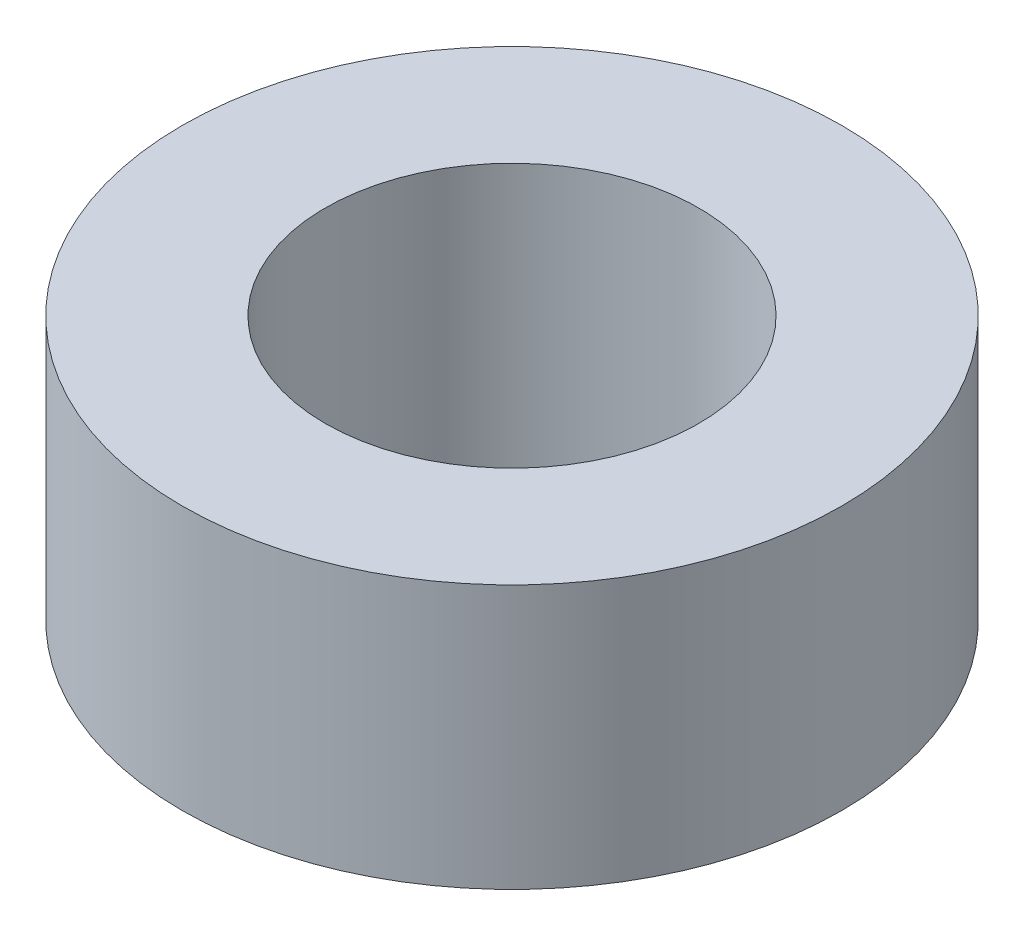
ISO-10303-21;
HEADER;
FILE_DESCRIPTION(('STEP AP214'),'2;1');
FILE_NAME('part.step','',(''),(''),'','','');
FILE_SCHEMA(('AUTOMOTIVE_DESIGN { 1 0 10303 214 1 1 1 1 }'));
ENDSEC;
DATA;
#1=APPLICATION_CONTEXT('core data for automotive mechanical design processes');
#2=APPLICATION_PROTOCOL_DEFINITION('international standard','automotive_design',2000,#1);
#3=PRODUCT_CONTEXT('',#1,'mechanical');
#4=PRODUCT('Part','Part','',(#3));
#5=PRODUCT_RELATED_PRODUCT_CATEGORY('part','',(#4));
#6=PRODUCT_DEFINITION_FORMATION('','',#4);
#7=PRODUCT_DEFINITION_CONTEXT('part definition',#1,'design');
#8=PRODUCT_DEFINITION('design','',#6,#7);
#9=PRODUCT_DEFINITION_SHAPE('','',#8);
#10=(LENGTH_UNIT() NAMED_UNIT(*) SI_UNIT(.MILLI.,.METRE.));
#11=(NAMED_UNIT(*) PLANE_ANGLE_UNIT() SI_UNIT($,.RADIAN.));
#12=(NAMED_UNIT(*) SI_UNIT($,.STERADIAN.) SOLID_ANGLE_UNIT());
#13=UNCERTAINTY_MEASURE_WITH_UNIT(LENGTH_MEASURE(1.E-05),#10,'distance_accuracy_value','');
#14=(GEOMETRIC_REPRESENTATION_CONTEXT(3) GLOBAL_UNCERTAINTY_ASSIGNED_CONTEXT((#13)) GLOBAL_UNIT_ASSIGNED_CONTEXT((#10,
#11,#12)) REPRESENTATION_CONTEXT('',''));
#15=CARTESIAN_POINT('',(0.,0.,0.));
#16=DIRECTION('',(0.,0.,1.));
#17=DIRECTION('',(1.,0.,0.));
#18=AXIS2_PLACEMENT_3D('',#15,#16,#17);
#19=CARTESIAN_POINT('',(0.,3.175,0.));
#20=DIRECTION('',(0.,1.,0.));
#21=DIRECTION('',(0.,0.,1.));
#22=AXIS2_PLACEMENT_3D('',#19,#20,#21);
#23=PLANE('',#22);
#24=CARTESIAN_POINT('',(0.,3.175,0.));
#25=DIRECTION('',(0.,1.,0.));
#26=DIRECTION('',(0.,0.,1.));
#27=AXIS2_PLACEMENT_3D('',#24,#25,#26);
#28=CIRCLE('',#27,3.96875);
#29=CARTESIAN_POINT('',(0.,3.175,3.96875));
#30=VERTEX_POINT('',#29);
#31=EDGE_CURVE('E10',#30,#30,#28,.T.);
#32=ORIENTED_EDGE('',*,*,#31,.T.);
#33=EDGE_LOOP('',(#32));
#34=FACE_BOUND('',#33,.T.);
#35=CARTESIAN_POINT('',(0.,3.175,0.));
#36=DIRECTION('',(0.,1.,0.));
#37=DIRECTION('',(0.,0.,1.));
#38=AXIS2_PLACEMENT_3D('',#35,#36,#37);
#39=CIRCLE('',#38,2.2479);
#40=CARTESIAN_POINT('',(0.,3.175,2.2479));
#41=VERTEX_POINT('',#40);
#42=EDGE_CURVE('E41',#41,#41,#39,.T.);
#43=ORIENTED_EDGE('',*,*,#42,.F.);
#44=EDGE_LOOP('',(#43));
#45=FACE_BOUND('',#44,.T.);
#46=ADVANCED_FACE('F30',(#34,#45),#23,.T.);
#47=CARTESIAN_POINT('',(0.,0.,0.));
#48=DIRECTION('',(0.,1.,0.));
#49=DIRECTION('',(0.,0.,1.));
#50=AXIS2_PLACEMENT_3D('',#47,#48,#49);
#51=PLANE('',#50);
#52=CARTESIAN_POINT('',(0.,0.,0.));
#53=DIRECTION('',(0.,1.,0.));
#54=DIRECTION('',(0.,0.,1.));
#55=AXIS2_PLACEMENT_3D('',#52,#53,#54);
#56=CIRCLE('',#55,3.96875);
#57=CARTESIAN_POINT('',(0.,0.,3.96875));
#58=VERTEX_POINT('',#57);
#59=EDGE_CURVE('E34',#58,#58,#56,.T.);
#60=ORIENTED_EDGE('',*,*,#59,.F.);
#61=EDGE_LOOP('',(#60));
#62=FACE_BOUND('',#61,.T.);
#63=CARTESIAN_POINT('',(0.,0.,0.));
#64=DIRECTION('',(0.,1.,0.));
#65=DIRECTION('',(0.,0.,1.));
#66=AXIS2_PLACEMENT_3D('',#63,#64,#65);
#67=CIRCLE('',#66,2.2479);
#68=CARTESIAN_POINT('',(0.,0.,2.2479));
#69=VERTEX_POINT('',#68);
#70=EDGE_CURVE('E43',#69,#69,#67,.T.);
#71=ORIENTED_EDGE('',*,*,#70,.T.);
#72=EDGE_LOOP('',(#71));
#73=FACE_BOUND('',#72,.T.);
#74=ADVANCED_FACE('F53',(#62,#73),#51,.F.);
#75=CARTESIAN_POINT('',(0.,3.175,0.));
#76=DIRECTION('',(0.,-1.,0.));
#77=DIRECTION('',(0.,0.,-1.));
#78=AXIS2_PLACEMENT_3D('',#75,#76,#77);
#79=CYLINDRICAL_SURFACE('',#78,3.96875);
#80=ORIENTED_EDGE('',*,*,#31,.F.);
#81=EDGE_LOOP('',(#80));
#82=FACE_BOUND('',#81,.T.);
#83=ORIENTED_EDGE('',*,*,#59,.T.);
#84=EDGE_LOOP('',(#83));
#85=FACE_BOUND('',#84,.T.);
#86=ADVANCED_FACE('F32',(#82,#85),#79,.T.);
#87=CARTESIAN_POINT('',(0.,3.175,0.));
#88=DIRECTION('',(0.,-1.,0.));
#89=DIRECTION('',(0.,0.,-1.));
#90=AXIS2_PLACEMENT_3D('',#87,#88,#89);
#91=CYLINDRICAL_SURFACE('',#90,2.2479);
#92=ORIENTED_EDGE('',*,*,#42,.T.);
#93=EDGE_LOOP('',(#92));
#94=FACE_BOUND('',#93,.T.);
#95=ORIENTED_EDGE('',*,*,#70,.F.);
#96=EDGE_LOOP('',(#95));
#97=FACE_BOUND('',#96,.T.);
#98=ADVANCED_FACE('F49',(#94,#97),#91,.F.);
#99=CLOSED_SHELL('',(#46,#74,#86,#98));
#100=MANIFOLD_SOLID_BREP('B2',#99);
#101=ADVANCED_BREP_SHAPE_REPRESENTATION('',(#18,#100),#14);
#102=SHAPE_DEFINITION_REPRESENTATION(#9,#101);
ENDSEC;
END-ISO-10303-21;
